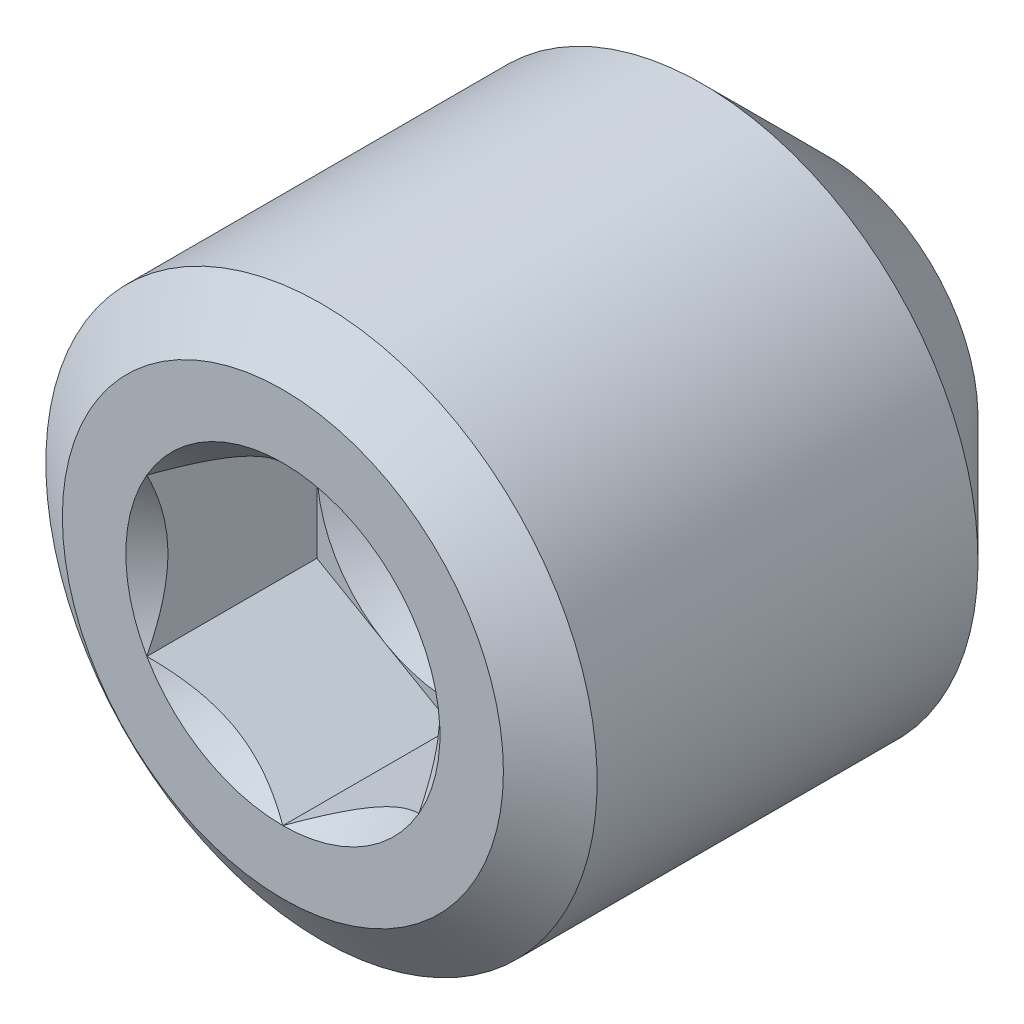
ISO-10303-21;
HEADER;
FILE_DESCRIPTION(('STEP AP214'),'2;1');
FILE_NAME('part.step','',(''),(''),'','','');
FILE_SCHEMA(('AUTOMOTIVE_DESIGN { 1 0 10303 214 1 1 1 1 }'));
ENDSEC;
DATA;
#1=APPLICATION_CONTEXT('core data for automotive mechanical design processes');
#2=APPLICATION_PROTOCOL_DEFINITION('international standard','automotive_design',2000,#1);
#3=PRODUCT_CONTEXT('',#1,'mechanical');
#4=PRODUCT('Part','Part','',(#3));
#5=PRODUCT_RELATED_PRODUCT_CATEGORY('part','',(#4));
#6=PRODUCT_DEFINITION_FORMATION('','',#4);
#7=PRODUCT_DEFINITION_CONTEXT('part definition',#1,'design');
#8=PRODUCT_DEFINITION('design','',#6,#7);
#9=PRODUCT_DEFINITION_SHAPE('','',#8);
#10=(LENGTH_UNIT() NAMED_UNIT(*) SI_UNIT(.MILLI.,.METRE.));
#11=(NAMED_UNIT(*) PLANE_ANGLE_UNIT() SI_UNIT($,.RADIAN.));
#12=(NAMED_UNIT(*) SI_UNIT($,.STERADIAN.) SOLID_ANGLE_UNIT());
#13=UNCERTAINTY_MEASURE_WITH_UNIT(LENGTH_MEASURE(1.E-05),#10,'distance_accuracy_value','');
#14=(GEOMETRIC_REPRESENTATION_CONTEXT(3) GLOBAL_UNCERTAINTY_ASSIGNED_CONTEXT((#13)) GLOBAL_UNIT_ASSIGNED_CONTEXT((#10,
#11,#12)) REPRESENTATION_CONTEXT('',''));
#15=CARTESIAN_POINT('',(0.,0.,0.));
#16=DIRECTION('',(0.,0.,1.));
#17=DIRECTION('',(1.,0.,0.));
#18=AXIS2_PLACEMENT_3D('',#15,#16,#17);
#19=CARTESIAN_POINT('',(0.,0.,0.495727982126937));
#20=DIRECTION('',(0.,0.,1.));
#21=DIRECTION('',(0.,-1.,0.));
#22=AXIS2_PLACEMENT_3D('',#19,#20,#21);
#23=CONICAL_SURFACE('',#22,1.19062499987876,1.04719755103086);
#24=CARTESIAN_POINT('',(2.55351295663786E-10,-1.4210854715202E-11,-0.19167968210354));
#25=VERTEX_POINT('',#24);
#26=VERTEX_LOOP('',#25);
#27=FACE_BOUND('',#26,.T.);
#28=CARTESIAN_POINT('',(0.,0.,0.495727982192662));
#29=DIRECTION('',(0.,0.,1.));
#30=DIRECTION('',(0.,-1.,0.));
#31=AXIS2_PLACEMENT_3D('',#28,#29,#30);
#32=CIRCLE('',#31,1.19062499999245);
#33=CARTESIAN_POINT('',(1.190624999996,-7.105427357601E-12,0.495727982183336));
#34=VERTEX_POINT('',#33);
#35=CARTESIAN_POINT('',(0.595312499997558,-1.0311114963848,0.495727982183336));
#36=VERTEX_POINT('',#35);
#37=EDGE_CURVE('E100',#34,#36,#32,.F.);
#38=ORIENTED_EDGE('',*,*,#37,.F.);
#39=CARTESIAN_POINT('',(0.,0.,0.495727982192662));
#40=DIRECTION('',(0.,0.,1.));
#41=DIRECTION('',(0.,-1.,0.));
#42=AXIS2_PLACEMENT_3D('',#39,#40,#41);
#43=CIRCLE('',#42,1.19062499999245);
#44=CARTESIAN_POINT('',(0.595312499999334,1.03111149636348,0.495727982183336));
#45=VERTEX_POINT('',#44);
#46=EDGE_CURVE('E114',#45,#34,#43,.F.);
#47=ORIENTED_EDGE('',*,*,#46,.F.);
#48=CARTESIAN_POINT('',(0.,0.,0.495727982192662));
#49=DIRECTION('',(0.,0.,1.));
#50=DIRECTION('',(0.,-1.,0.));
#51=AXIS2_PLACEMENT_3D('',#48,#49,#50);
#52=CIRCLE('',#51,1.19062499999245);
#53=CARTESIAN_POINT('',(-0.595312499998446,1.03111149636348,0.495727982183336));
#54=VERTEX_POINT('',#53);
#55=EDGE_CURVE('E255',#54,#45,#52,.F.);
#56=ORIENTED_EDGE('',*,*,#55,.F.);
#57=CARTESIAN_POINT('',(0.,0.,0.495727982192662));
#58=DIRECTION('',(0.,0.,1.));
#59=DIRECTION('',(0.,-1.,0.));
#60=AXIS2_PLACEMENT_3D('',#57,#58,#59);
#61=CIRCLE('',#60,1.19062499999245);
#62=CARTESIAN_POINT('',(-1.19062499999645,-1.24344978758018E-11,0.495727982183336));
#63=VERTEX_POINT('',#62);
#64=EDGE_CURVE('E151',#63,#54,#61,.F.);
#65=ORIENTED_EDGE('',*,*,#64,.F.);
#66=CARTESIAN_POINT('',(0.,0.,0.495727982192662));
#67=DIRECTION('',(0.,0.,1.));
#68=DIRECTION('',(0.,-1.,0.));
#69=AXIS2_PLACEMENT_3D('',#66,#67,#68);
#70=CIRCLE('',#69,1.19062499999245);
#71=CARTESIAN_POINT('',(-0.595312499998446,-1.0311114963848,0.495727982183336));
#72=VERTEX_POINT('',#71);
#73=EDGE_CURVE('E19',#72,#63,#70,.F.);
#74=ORIENTED_EDGE('',*,*,#73,.F.);
#75=CARTESIAN_POINT('',(0.,0.,0.495727982192662));
#76=DIRECTION('',(0.,0.,1.));
#77=DIRECTION('',(0.,-1.,0.));
#78=AXIS2_PLACEMENT_3D('',#75,#76,#77);
#79=CIRCLE('',#78,1.19062499999245);
#80=EDGE_CURVE('E379',#36,#72,#79,.F.);
#81=ORIENTED_EDGE('',*,*,#80,.F.);
#82=EDGE_LOOP('',(#38,#47,#56,#65,#74,#81));
#83=FACE_BOUND('',#82,.T.);
#84=ADVANCED_FACE('F16',(#27,#83),#23,.F.);
#85=CARTESIAN_POINT('',(-1.19062500000044,2.06222299274827,0.495727982174454));
#86=DIRECTION('',(0.,0.,1.));
#87=DIRECTION('',(0.,-1.,0.));
#88=AXIS2_PLACEMENT_3D('',#85,#86,#87);
#89=PLANE('',#88);
#90=DIRECTION('',(0.,-1.,0.));
#91=VECTOR('',#90,1.);
#92=CARTESIAN_POINT('',(-1.19062500000089,0.687407664246464,0.495727982174454));
#93=LINE('',#92,#91);
#94=CARTESIAN_POINT('',(-1.190625,-0.687407664262452,0.495727982174454));
#95=VERTEX_POINT('',#94);
#96=EDGE_CURVE('E83',#63,#95,#93,.T.);
#97=ORIENTED_EDGE('',*,*,#96,.T.);
#98=DIRECTION('',(0.866025403784439,-0.500000000000002,0.));
#99=VECTOR('',#98,1.);
#100=CARTESIAN_POINT('',(-1.190625,-0.687407664262452,0.495727982174454));
#101=LINE('',#100,#99);
#102=EDGE_CURVE('E167',#95,#72,#101,.T.);
#103=ORIENTED_EDGE('',*,*,#102,.T.);
#104=ORIENTED_EDGE('',*,*,#73,.T.);
#105=EDGE_LOOP('',(#97,#103,#104));
#106=FACE_BOUND('',#105,.T.);
#107=ADVANCED_FACE('F272',(#106),#89,.T.);
#108=CARTESIAN_POINT('',(-1.19062500000044,2.06222299274827,0.495727982174454));
#109=DIRECTION('',(0.,0.,1.));
#110=DIRECTION('',(0.,-1.,0.));
#111=AXIS2_PLACEMENT_3D('',#108,#109,#110);
#112=PLANE('',#111);
#113=DIRECTION('',(0.866025403784439,-0.500000000000002,0.));
#114=VECTOR('',#113,1.);
#115=CARTESIAN_POINT('',(-1.190625,-0.687407664262452,0.495727982174454));
#116=LINE('',#115,#114);
#117=CARTESIAN_POINT('',(-4.44089209850063E-13,-1.37481532852135,0.495727982174454));
#118=VERTEX_POINT('',#117);
#119=EDGE_CURVE('E133',#72,#118,#116,.T.);
#120=ORIENTED_EDGE('',*,*,#119,.T.);
#121=DIRECTION('',(0.866025403784439,0.5,0.));
#122=VECTOR('',#121,1.);
#123=CARTESIAN_POINT('',(-4.44089209850063E-13,-1.37481532852135,0.495727982174454));
#124=LINE('',#123,#122);
#125=EDGE_CURVE('E105',#118,#36,#124,.T.);
#126=ORIENTED_EDGE('',*,*,#125,.T.);
#127=ORIENTED_EDGE('',*,*,#80,.T.);
#128=EDGE_LOOP('',(#120,#126,#127));
#129=FACE_BOUND('',#128,.T.);
#130=ADVANCED_FACE('F270',(#129),#112,.T.);
#131=CARTESIAN_POINT('',(-1.19062500000044,2.06222299274827,0.495727982174454));
#132=DIRECTION('',(0.,0.,1.));
#133=DIRECTION('',(0.,-1.,0.));
#134=AXIS2_PLACEMENT_3D('',#131,#132,#133);
#135=PLANE('',#134);
#136=DIRECTION('',(0.866025403784439,0.5,0.));
#137=VECTOR('',#136,1.);
#138=CARTESIAN_POINT('',(-4.44089209850063E-13,-1.37481532852135,0.495727982174454));
#139=LINE('',#138,#137);
#140=CARTESIAN_POINT('',(1.190625,-0.687407664267781,0.495727982174454));
#141=VERTEX_POINT('',#140);
#142=EDGE_CURVE('E95',#36,#141,#139,.T.);
#143=ORIENTED_EDGE('',*,*,#142,.T.);
#144=DIRECTION('',(0.,1.,0.));
#145=VECTOR('',#144,1.);
#146=CARTESIAN_POINT('',(1.190625,-0.687407664267781,0.495727982174454));
#147=LINE('',#146,#145);
#148=EDGE_CURVE('E98',#141,#34,#147,.T.);
#149=ORIENTED_EDGE('',*,*,#148,.T.);
#150=ORIENTED_EDGE('',*,*,#37,.T.);
#151=EDGE_LOOP('',(#143,#149,#150));
#152=FACE_BOUND('',#151,.T.);
#153=ADVANCED_FACE('F97',(#152),#135,.T.);
#154=CARTESIAN_POINT('',(-1.19062500000044,2.06222299274827,0.495727982174454));
#155=DIRECTION('',(0.,0.,1.));
#156=DIRECTION('',(0.,-1.,0.));
#157=AXIS2_PLACEMENT_3D('',#154,#155,#156);
#158=PLANE('',#157);
#159=DIRECTION('',(0.,1.,0.));
#160=VECTOR('',#159,1.);
#161=CARTESIAN_POINT('',(1.190625,-0.687407664267781,0.495727982174454));
#162=LINE('',#161,#160);
#163=CARTESIAN_POINT('',(1.19062500000044,0.687407664241135,0.495727982174454));
#164=VERTEX_POINT('',#163);
#165=EDGE_CURVE('E113',#34,#164,#162,.T.);
#166=ORIENTED_EDGE('',*,*,#165,.T.);
#167=DIRECTION('',(-0.86602540378444,0.500000000000002,0.));
#168=VECTOR('',#167,1.);
#169=CARTESIAN_POINT('',(1.19062500000044,0.687407664241135,0.495727982174454));
#170=LINE('',#169,#168);
#171=EDGE_CURVE('E124',#164,#45,#170,.T.);
#172=ORIENTED_EDGE('',*,*,#171,.T.);
#173=ORIENTED_EDGE('',*,*,#46,.T.);
#174=EDGE_LOOP('',(#166,#172,#173));
#175=FACE_BOUND('',#174,.T.);
#176=ADVANCED_FACE('F263',(#175),#158,.T.);
#177=CARTESIAN_POINT('',(1.190625,-0.687407664267781,0.495727982174454));
#178=DIRECTION('',(1.,0.,0.));
#179=DIRECTION('',(0.,1.,0.));
#180=AXIS2_PLACEMENT_3D('',#177,#178,#179);
#181=PLANE('',#180);
#182=CARTESIAN_POINT('',(1.19062499999556,0.687407664289097,1.98400923211484));
#183=CARTESIAN_POINT('',(1.1906249999984,0.640463282074573,1.96055894231369));
#184=CARTESIAN_POINT('',(1.19062499999957,0.592738991384884,1.93847791824531));
#185=CARTESIAN_POINT('',(1.19062500000044,0.495406225211971,1.89800295513786));
#186=CARTESIAN_POINT('',(1.19062500000012,0.445787629505238,1.87963356850172));
#187=CARTESIAN_POINT('',(1.19062499999989,0.3451163757076,1.84791358583423));
#188=CARTESIAN_POINT('',(1.19062499999997,0.294069215437679,1.83454600462104));
#189=CARTESIAN_POINT('',(1.19062500000003,0.190855854632015,1.81396603547113));
#190=CARTESIAN_POINT('',(1.190625,0.138693632933228,1.8067346135158));
#191=CARTESIAN_POINT('',(1.190625,0.071951112856019,1.80190389372878));
#192=CARTESIAN_POINT('',(1.190625,0.0575681065408894,1.80112291749213));
#193=CARTESIAN_POINT('',(1.190625,0.0287907386402001,1.80008032792752));
#194=CARTESIAN_POINT('',(1.190625,0.0143963874795497,1.79981843246641));
#195=CARTESIAN_POINT('',(1.190625,-0.0361321030584912,1.79982008619975));
#196=CARTESIAN_POINT('',(1.19062500000002,-0.072277033158264,1.80147394594917));
#197=CARTESIAN_POINT('',(1.19062499999998,-0.144284982616348,1.80799116290055));
#198=CARTESIAN_POINT('',(1.19062499999991,-0.180147787681774,1.81285675865009));
#199=CARTESIAN_POINT('',(1.19062500000018,-0.287258251721114,1.8319669698351));
#200=CARTESIAN_POINT('',(1.19062500000101,-0.35772529740938,1.85072176782383));
#201=CARTESIAN_POINT('',(1.19062500000081,-0.471552892513589,1.88908925370785));
#202=CARTESIAN_POINT('',(1.19062500000033,-0.515840765963648,1.90614997876421));
#203=CARTESIAN_POINT('',(1.19062499999967,-0.60273957314956,1.94312607455278));
#204=CARTESIAN_POINT('',(1.1906249999995,-0.645362139972149,1.96301390794671));
#205=CARTESIAN_POINT('',(1.190625,-0.687407664294426,1.98400923211306));
#206=B_SPLINE_CURVE_WITH_KNOTS('',3,(#182,#183,#184,#185,#186,#187,#188,#189,#190,#191,#192,
#193,#194,#195,#196,#197,#198,#199,#200,#201,#202,#203,#204,#205),.UNSPECIFIED.,.F.,.F.,(4,2,2,
2,2,2,2,2,2,2,2,4),(0.,0.157535403144177,0.316081041542013,0.47408329470111,0.631593623247327,
0.674799715143058,0.717982317018622,0.826362160395384,0.934817623304514,1.15262451061384,
1.29491478060888,1.43590359051069),.UNSPECIFIED.);
#207=CARTESIAN_POINT('',(1.19062500005773,0.687407664239359,1.9840092321366));
#208=VERTEX_POINT('',#207);
#209=CARTESIAN_POINT('',(1.19062500002931,-0.687407664285544,1.98400923212683));
#210=VERTEX_POINT('',#209);
#211=EDGE_CURVE('E159',#208,#210,#206,.T.);
#212=ORIENTED_EDGE('',*,*,#211,.F.);
#213=DIRECTION('',(0.,0.,1.));
#214=VECTOR('',#213,1.);
#215=CARTESIAN_POINT('',(1.19062500000044,0.687407664241135,0.495727982174454));
#216=LINE('',#215,#214);
#217=EDGE_CURVE('E139',#208,#164,#216,.F.);
#218=ORIENTED_EDGE('',*,*,#217,.T.);
#219=ORIENTED_EDGE('',*,*,#165,.F.);
#220=ORIENTED_EDGE('',*,*,#148,.F.);
#221=DIRECTION('',(0.,0.,1.));
#222=VECTOR('',#221,1.);
#223=CARTESIAN_POINT('',(1.190625,-0.687407664267781,0.495727982174454));
#224=LINE('',#223,#222);
#225=EDGE_CURVE('E104',#141,#210,#224,.T.);
#226=ORIENTED_EDGE('',*,*,#225,.T.);
#227=EDGE_LOOP('',(#212,#218,#219,#220,#226));
#228=FACE_BOUND('',#227,.T.);
#229=ADVANCED_FACE('F110',(#228),#181,.F.);
#230=CARTESIAN_POINT('',(-1.19062500000044,2.06222299274827,0.495727982174454));
#231=DIRECTION('',(0.,0.,1.));
#232=DIRECTION('',(0.,-1.,0.));
#233=AXIS2_PLACEMENT_3D('',#230,#231,#232);
#234=PLANE('',#233);
#235=DIRECTION('',(-0.86602540378444,0.500000000000002,0.));
#236=VECTOR('',#235,1.);
#237=CARTESIAN_POINT('',(1.19062500000044,0.687407664241135,0.495727982174454));
#238=LINE('',#237,#236);
#239=CARTESIAN_POINT('',(1.77635683940025E-12,1.37481532850714,0.495727982174454));
#240=VERTEX_POINT('',#239);
#241=EDGE_CURVE('E136',#45,#240,#238,.T.);
#242=ORIENTED_EDGE('',*,*,#241,.T.);
#243=DIRECTION('',(-0.866025403784439,-0.5,0.));
#244=VECTOR('',#243,1.);
#245=CARTESIAN_POINT('',(1.77635683940025E-12,1.37481532850714,0.495727982174454));
#246=LINE('',#245,#244);
#247=EDGE_CURVE('E142',#240,#54,#246,.T.);
#248=ORIENTED_EDGE('',*,*,#247,.T.);
#249=ORIENTED_EDGE('',*,*,#55,.T.);
#250=EDGE_LOOP('',(#242,#248,#249));
#251=FACE_BOUND('',#250,.T.);
#252=ADVANCED_FACE('F262',(#251),#234,.T.);
#253=CARTESIAN_POINT('',(-1.19062500000044,2.06222299274827,0.495727982174454));
#254=DIRECTION('',(0.,0.,1.));
#255=DIRECTION('',(0.,-1.,0.));
#256=AXIS2_PLACEMENT_3D('',#253,#254,#255);
#257=PLANE('',#256);
#258=DIRECTION('',(-0.866025403784439,-0.5,0.));
#259=VECTOR('',#258,1.);
#260=CARTESIAN_POINT('',(1.77635683940025E-12,1.37481532850714,0.495727982174454));
#261=LINE('',#260,#259);
#262=CARTESIAN_POINT('',(-1.19062500000089,0.687407664246464,0.495727982174454));
#263=VERTEX_POINT('',#262);
#264=EDGE_CURVE('E145',#54,#263,#261,.T.);
#265=ORIENTED_EDGE('',*,*,#264,.T.);
#266=DIRECTION('',(0.,-1.,0.));
#267=VECTOR('',#266,1.);
#268=CARTESIAN_POINT('',(-1.19062500000089,0.687407664246464,0.495727982174454));
#269=LINE('',#268,#267);
#270=EDGE_CURVE('E148',#263,#63,#269,.T.);
#271=ORIENTED_EDGE('',*,*,#270,.T.);
#272=ORIENTED_EDGE('',*,*,#64,.T.);
#273=EDGE_LOOP('',(#265,#271,#272));
#274=FACE_BOUND('',#273,.T.);
#275=ADVANCED_FACE('F365',(#274),#257,.T.);
#276=CARTESIAN_POINT('',(-1.19062500000089,0.687407664246464,0.495727982174454));
#277=DIRECTION('',(-1.,0.,0.));
#278=DIRECTION('',(0.,-1.,0.));
#279=AXIS2_PLACEMENT_3D('',#276,#277,#278);
#280=PLANE('',#279);
#281=CARTESIAN_POINT('',(-1.19062499999689,0.687407664289097,1.98400923211572));
#282=CARTESIAN_POINT('',(-1.19062499999953,0.640154592182397,1.96040536744295));
#283=CARTESIAN_POINT('',(-1.19062500000054,0.592111444460251,1.93818802847184));
#284=CARTESIAN_POINT('',(-1.19062500000124,0.494146535981105,1.89750902941565));
#285=CARTESIAN_POINT('',(-1.19062500000091,0.444215463847035,1.87906999571721));
#286=CARTESIAN_POINT('',(-1.19062500000087,0.343531912612561,1.84748380274666));
#287=CARTESIAN_POINT('',(-1.19062500000114,0.292805060654056,1.83425727427423));
#288=CARTESIAN_POINT('',(-1.19062500000063,0.190234889567651,1.81387930354997));
#289=CARTESIAN_POINT('',(-1.19062499999985,0.13839470162241,1.80671265556498));
#290=CARTESIAN_POINT('',(-1.19062500000011,0.0490434171387624,1.80024610056026));
#291=CARTESIAN_POINT('',(-1.19062500000069,0.0116476312196913,1.79928918177818));
#292=CARTESIAN_POINT('',(-1.19062500000109,-0.0630781169179072,1.80090396128286));
#293=CARTESIAN_POINT('',(-1.19062500000089,-0.100408062772507,1.80347643903115));
#294=CARTESIAN_POINT('',(-1.19062500000089,-0.174707550778307,1.81200130363435));
#295=CARTESIAN_POINT('',(-1.19062500000107,-0.211676725232483,1.81795683342425));
#296=CARTESIAN_POINT('',(-1.19062500000071,-0.284997830962193,1.8329270532167));
#297=CARTESIAN_POINT('',(-1.19062500000016,-0.321349490340824,1.84194305589462));
#298=CARTESIAN_POINT('',(-1.19062499999975,-0.414409407720663,1.86868846791181));
#299=CARTESIAN_POINT('',(-1.19062500000047,-0.47053205912835,1.88842523326287));
#300=CARTESIAN_POINT('',(-1.19062500000131,-0.580581647465353,1.93288237139641));
#301=CARTESIAN_POINT('',(-1.19062500000143,-0.634515062280037,1.9575865213319));
#302=CARTESIAN_POINT('',(-1.190625,-0.687407664303308,1.98400923211395));
#303=B_SPLINE_CURVE_WITH_KNOTS('',3,(#281,#282,#283,#284,#285,#286,#287,#288,#289,#290,#291,
#292,#293,#294,#295,#296,#297,#298,#299,#300,#301,#302),.UNSPECIFIED.,.F.,.F.,(4,2,2,2,2,2,2,2,
2,2,4),(0.,0.158570945781735,0.31806539782726,0.475027617268127,0.63159480107284,
0.74366016076398,0.855750273893167,0.967944692083056,1.08018729280444,1.25836291045971,
1.43596581394564),.UNSPECIFIED.);
#304=CARTESIAN_POINT('',(-1.19062500002842,0.687407664264228,1.98400923212683));
#305=VERTEX_POINT('',#304);
#306=CARTESIAN_POINT('',(-1.19062500005951,-0.687407664250017,1.98400923213704));
#307=VERTEX_POINT('',#306);
#308=EDGE_CURVE('E317',#305,#307,#303,.T.);
#309=ORIENTED_EDGE('',*,*,#308,.T.);
#310=DIRECTION('',(0.,0.,1.));
#311=VECTOR('',#310,1.);
#312=CARTESIAN_POINT('',(-1.190625,-0.687407664262452,0.495727982174454));
#313=LINE('',#312,#311);
#314=EDGE_CURVE('E131',#307,#95,#313,.F.);
#315=ORIENTED_EDGE('',*,*,#314,.T.);
#316=ORIENTED_EDGE('',*,*,#96,.F.);
#317=ORIENTED_EDGE('',*,*,#270,.F.);
#318=DIRECTION('',(0.,0.,1.));
#319=VECTOR('',#318,1.);
#320=CARTESIAN_POINT('',(-1.19062500000089,0.687407664246464,0.495727982174454));
#321=LINE('',#320,#319);
#322=EDGE_CURVE('E155',#263,#305,#321,.T.);
#323=ORIENTED_EDGE('',*,*,#322,.T.);
#324=EDGE_LOOP('',(#309,#315,#316,#317,#323));
#325=FACE_BOUND('',#324,.T.);
#326=ADVANCED_FACE('F336',(#325),#280,.F.);
#327=CARTESIAN_POINT('',(-1.190625,-0.687407664262452,0.495727982174454));
#328=DIRECTION('',(-0.5,-0.866025403784439,0.));
#329=DIRECTION('',(0.866025403784439,-0.500000000000002,0.));
#330=AXIS2_PLACEMENT_3D('',#327,#328,#329);
#331=PLANE('',#330);
#332=CARTESIAN_POINT('',(-1.19062500003375,-0.687407664237583,1.98400923211572));
#333=CARTESIAN_POINT('',(-1.14970263918224,-0.711034200293792,1.96040536744716));
#334=CARTESIAN_POINT('',(-1.10809605277734,-0.735055774156504,1.93818802847732));
#335=CARTESIAN_POINT('',(-1.02325595335482,-0.784038228397947,1.89750902942154));
#336=CARTESIAN_POINT('',(-0.9800143764481,-0.809003764465214,1.87906999572228));
#337=CARTESIAN_POINT('',(-0.892819863334365,-0.859345540081545,1.84748380275269));
#338=CARTESIAN_POINT('',(-0.848889120883299,-0.884708966059667,1.83425727428194));
#339=CARTESIAN_POINT('',(-0.760060747054684,-0.935994051606419,1.81387930355408));
#340=CARTESIAN_POINT('',(-0.715165827360859,-0.9619141455837,1.80671265556379));
#341=CARTESIAN_POINT('',(-0.637785345138153,-1.00658978782268,1.80024610056122));
#342=CARTESIAN_POINT('',(-0.605399644536867,-1.02528768077758,1.79928918178329));
#343=CARTESIAN_POINT('',(-0.540685248333886,-1.06265055484202,1.80090396129061));
#344=CARTESIAN_POINT('',(-0.50835656690377,-1.08131552776959,1.80347643903741));
#345=CARTESIAN_POINT('',(-0.44401132280558,-1.11846527177186,1.81200130363909));
#346=CARTESIAN_POINT('',(-0.41199507857247,-1.13694985899803,1.81795683342896));
#347=CARTESIAN_POINT('',(-0.348497138378873,-1.17361041186119,1.8329270532196));
#348=CARTESIAN_POINT('',(-0.317015677888011,-1.19178624154973,1.84194305589574));
#349=CARTESIAN_POINT('',(-0.236423425361618,-1.23831620023999,1.86868846791133));
#350=CARTESIAN_POINT('',(-0.187819783513171,-1.26637752594494,1.8884252332641));
#351=CARTESIAN_POINT('',(-0.0925140443342337,-1.3214023201171,1.93288237139957));
#352=CARTESIAN_POINT('',(-0.0458063369904475,-1.348369027527,1.95758652133528));
#353=CARTESIAN_POINT('',(3.59712259978551E-11,-1.37481532854267,1.98400923211395));
#354=B_SPLINE_CURVE_WITH_KNOTS('',3,(#332,#333,#334,#335,#336,#337,#338,#339,#340,#341,#342,
#343,#344,#345,#346,#347,#348,#349,#350,#351,#352,#353),.UNSPECIFIED.,.F.,.F.,(4,2,2,2,2,2,2,2,
2,2,4),(0.,0.158570945781518,0.318065397829123,0.475027617270162,0.631594801073887,
0.743660160759904,0.855750273884707,0.967944692070207,1.0801872927873,1.25836291044979,
1.43596581394249),.UNSPECIFIED.);
#355=CARTESIAN_POINT('',(-4.04121180963557E-11,-1.37481532856576,1.98400923213704));
#356=VERTEX_POINT('',#355);
#357=EDGE_CURVE('E322',#307,#356,#354,.T.);
#358=ORIENTED_EDGE('',*,*,#357,.T.);
#359=DIRECTION('',(0.,0.,1.));
#360=VECTOR('',#359,1.);
#361=CARTESIAN_POINT('',(-4.44089209850063E-13,-1.37481532852135,0.495727982174454));
#362=LINE('',#361,#360);
#363=EDGE_CURVE('E121',#356,#118,#362,.F.);
#364=ORIENTED_EDGE('',*,*,#363,.T.);
#365=ORIENTED_EDGE('',*,*,#119,.F.);
#366=ORIENTED_EDGE('',*,*,#102,.F.);
#367=ORIENTED_EDGE('',*,*,#314,.F.);
#368=EDGE_LOOP('',(#358,#364,#365,#366,#367));
#369=FACE_BOUND('',#368,.T.);
#370=ADVANCED_FACE('F358',(#369),#331,.F.);
#371=CARTESIAN_POINT('',(-4.44089209850063E-13,-1.37481532852135,0.495727982174454));
#372=DIRECTION('',(0.500000000000001,-0.866025403784441,0.));
#373=DIRECTION('',(0.866025403784439,0.5,0.));
#374=AXIS2_PLACEMENT_3D('',#371,#372,#373);
#375=PLANE('',#374);
#376=CARTESIAN_POINT('',(-3.81916720471054E-11,-1.37481532853201,1.98400923211572));
#377=CARTESIAN_POINT('',(0.0409223608183264,-1.35118879248267,1.96040536745191));
#378=CARTESIAN_POINT('',(0.0825289472250635,-1.32716721862365,1.93818802848377));
#379=CARTESIAN_POINT('',(0.167369046648473,-1.27818476438571,1.89750902942892));
#380=CARTESIAN_POINT('',(0.210610623554248,-1.25321922831823,1.87906999572894));
#381=CARTESIAN_POINT('',(0.297805136665731,-1.20287745270072,1.84748380275982));
#382=CARTESIAN_POINT('',(0.341735879115486,-1.17751402672165,1.83425727429021));
#383=CARTESIAN_POINT('',(0.430564252944685,-1.12622894118041,1.81387930355865));
#384=CARTESIAN_POINT('',(0.47545917264039,-1.10030884720958,1.80671265556349));
#385=CARTESIAN_POINT('',(0.552839654860742,-1.05563320496926,1.80024610056139));
#386=CARTESIAN_POINT('',(0.585225355459541,-1.03693531201001,1.79928918178632));
#387=CARTESIAN_POINT('',(0.64993975166087,-0.999572437942574,1.8009039612951));
#388=CARTESIAN_POINT('',(0.682268433091823,-0.980907465016348,1.80347643904051));
#389=CARTESIAN_POINT('',(0.746613677190298,-0.943757721014217,1.81200130364052));
#390=CARTESIAN_POINT('',(0.778629921422855,-0.925273133786822,1.81795683343009));
#391=CARTESIAN_POINT('',(0.842127861617899,-0.888612580925606,1.83292705322019));
#392=CARTESIAN_POINT('',(0.873609322110761,-0.870436751240239,1.84194305589609));
#393=CARTESIAN_POINT('',(0.954201574639311,-0.823906792552341,1.86868846791081));
#394=CARTESIAN_POINT('',(1.00280521648607,-0.795845466843196,1.8884252332628));
#395=CARTESIAN_POINT('',(1.09811095566217,-0.740820672664383,1.93288237139753));
#396=CARTESIAN_POINT('',(1.14481866300482,-0.713853965252028,1.95758652133326));
#397=CARTESIAN_POINT('',(1.19062500003375,-0.687407664241135,1.98400923211306));
#398=B_SPLINE_CURVE_WITH_KNOTS('',3,(#376,#377,#378,#379,#380,#381,#382,#383,#384,#385,#386,
#387,#388,#389,#390,#391,#392,#393,#394,#395,#396,#397),.UNSPECIFIED.,.F.,.F.,(4,2,2,2,2,2,2,2,
2,2,4),(0.,0.158570945778493,0.318065397824789,0.475027617263527,0.631594801064125,
0.743660160749816,0.855750273874792,0.967944692060373,1.08018729277778,1.25836291044123,
1.43596581393463),.UNSPECIFIED.);
#399=EDGE_CURVE('E119',#356,#210,#398,.T.);
#400=ORIENTED_EDGE('',*,*,#399,.T.);
#401=ORIENTED_EDGE('',*,*,#225,.F.);
#402=ORIENTED_EDGE('',*,*,#142,.F.);
#403=ORIENTED_EDGE('',*,*,#125,.F.);
#404=ORIENTED_EDGE('',*,*,#363,.F.);
#405=EDGE_LOOP('',(#400,#401,#402,#403,#404));
#406=FACE_BOUND('',#405,.T.);
#407=ADVANCED_FACE('F116',(#406),#375,.F.);
#408=CARTESIAN_POINT('',(1.19062500000044,0.687407664241135,0.495727982174454));
#409=DIRECTION('',(0.5,0.86602540378444,0.));
#410=DIRECTION('',(-0.86602540378444,0.500000000000002,0.));
#411=AXIS2_PLACEMENT_3D('',#408,#409,#410);
#412=PLANE('',#411);
#413=CARTESIAN_POINT('',(1.1906250000302,0.687407664221595,1.98400923211484));
#414=CARTESIAN_POINT('',(1.14970263917974,0.711034200274823,1.96040536743733));
#415=CARTESIAN_POINT('',(1.10809605277492,0.735055774136912,1.93818802846475));
#416=CARTESIAN_POINT('',(1.02325595335358,0.784038228377534,1.89750902940791));
#417=CARTESIAN_POINT('',(0.980014376448007,0.809003764444577,1.87906999571018));
#418=CARTESIAN_POINT('',(0.892819863336214,0.859345540059056,1.84748380273744));
#419=CARTESIAN_POINT('',(0.848889120885923,0.884708966035585,1.83425727426216));
#420=CARTESIAN_POINT('',(0.760060747058237,0.935994051584812,1.81387930354372));
#421=CARTESIAN_POINT('',(0.715165827364537,0.961914145566164,1.80671265556748));
#422=CARTESIAN_POINT('',(0.637785345139678,1.006589787805,1.80024610055855));
#423=CARTESIAN_POINT('',(0.605399644536666,1.02528768075777,1.79928918176889));
#424=CARTESIAN_POINT('',(0.540685248332495,1.06265055482063,1.80090396126813));
#425=CARTESIAN_POINT('',(0.508356566902914,1.08131552774876,1.8034764390185));
#426=CARTESIAN_POINT('',(0.444011322804208,1.11846527175186,1.81200130361965));
#427=CARTESIAN_POINT('',(0.411995078570049,1.13694985897832,1.81795683340545));
#428=CARTESIAN_POINT('',(0.348497138377735,1.17361041184084,1.83292705320394));
#429=CARTESIAN_POINT('',(0.317015677889209,1.19178624152845,1.84194305589203));
#430=CARTESIAN_POINT('',(0.236423425362963,1.23831620021872,1.86868846791729));
#431=CARTESIAN_POINT('',(0.187819783508982,1.26637752592597,1.88842523325531));
#432=CARTESIAN_POINT('',(0.0925140443242337,1.32140232010215,1.93288237137314));
#433=CARTESIAN_POINT('',(0.0458063369801493,1.34836902751377,1.95758652130591));
#434=CARTESIAN_POINT('',(-3.59712259978551E-11,1.37481532852846,1.98400923211395));
#435=B_SPLINE_CURVE_WITH_KNOTS('',3,(#413,#414,#415,#416,#417,#418,#419,#420,#421,#422,#423,
#424,#425,#426,#427,#428,#429,#430,#431,#432,#433,#434),.UNSPECIFIED.,.F.,.F.,(4,2,2,2,2,2,2,2,
2,2,4),(0.,0.158570945784662,0.318065397828007,0.475027617266539,0.631594801071782,
0.743660160760323,0.855750273884786,0.967944692071018,1.08018729278969,1.25836291045543,
1.43596581395099),.UNSPECIFIED.);
#436=CARTESIAN_POINT('',(3.99680288865056E-11,1.37481532855155,1.98400923213704));
#437=VERTEX_POINT('',#436);
#438=EDGE_CURVE('E34',#208,#437,#435,.T.);
#439=ORIENTED_EDGE('',*,*,#438,.T.);
#440=DIRECTION('',(0.,0.,1.));
#441=VECTOR('',#440,1.);
#442=CARTESIAN_POINT('',(1.77635683940025E-12,1.37481532850714,0.495727982174454));
#443=LINE('',#442,#441);
#444=EDGE_CURVE('E315',#437,#240,#443,.F.);
#445=ORIENTED_EDGE('',*,*,#444,.T.);
#446=ORIENTED_EDGE('',*,*,#241,.F.);
#447=ORIENTED_EDGE('',*,*,#171,.F.);
#448=ORIENTED_EDGE('',*,*,#217,.F.);
#449=EDGE_LOOP('',(#439,#445,#446,#447,#448));
#450=FACE_BOUND('',#449,.T.);
#451=ADVANCED_FACE('F357',(#450),#412,.F.);
#452=CARTESIAN_POINT('',(1.77635683940025E-12,1.37481532850714,0.495727982174454));
#453=DIRECTION('',(-0.500000000000001,0.866025403784441,0.));
#454=DIRECTION('',(-0.866025403784439,-0.5,0.));
#455=AXIS2_PLACEMENT_3D('',#452,#453,#454);
#456=PLANE('',#455);
#457=CARTESIAN_POINT('',(3.64153152077051E-11,1.37481532851247,1.98400923211572));
#458=CARTESIAN_POINT('',(-0.040922360818665,1.35118879246676,1.96040536744125));
#459=CARTESIAN_POINT('',(-0.0825289472253031,1.32716721860846,1.93818802846957));
#460=CARTESIAN_POINT('',(-0.167369046648449,1.27818476437082,1.89750902941318));
#461=CARTESIAN_POINT('',(-0.21061062355402,1.25321922830293,1.87906999571508));
#462=CARTESIAN_POINT('',(-0.297805136665481,1.20287745268632,1.84748380274452));
#463=CARTESIAN_POINT('',(-0.34173587911543,1.17751402670853,1.83425727427172));
#464=CARTESIAN_POINT('',(-0.430564252944477,1.12622894116373,1.81387930354878));
#465=CARTESIAN_POINT('',(-0.475459172639857,1.10030884718806,1.80671265556552));
#466=CARTESIAN_POINT('',(-0.552839654862542,1.05563320494815,1.80024610055995));
#467=CARTESIAN_POINT('',(-0.585225355463145,1.03693531199168,1.7992891817763));
#468=CARTESIAN_POINT('',(-0.649939751665587,0.999572437926137,1.80090396127971));
#469=CARTESIAN_POINT('',(-0.682268433095848,0.980907464999017,1.80347643902827));
#470=CARTESIAN_POINT('',(-0.746613677194548,0.943757720996809,1.8120013036298));
#471=CARTESIAN_POINT('',(-0.778629921428023,0.925273133770234,1.81795683341777));
#472=CARTESIAN_POINT('',(-0.84212786162108,0.888612580907412,1.83292705321214));
#473=CARTESIAN_POINT('',(-0.873609322111036,0.870436751219617,1.84194305589393));
#474=CARTESIAN_POINT('',(-0.954201574638312,0.823906792529585,1.86868846791444));
#475=CARTESIAN_POINT('',(-1.00280521649,0.795845466823384,1.88842523326073));
#476=CARTESIAN_POINT('',(-1.09811095567173,0.740820672646438,1.93288237138822));
#477=CARTESIAN_POINT('',(-1.14481866301507,0.713853965233017,1.95758652132238));
#478=CARTESIAN_POINT('',(-1.19062500003508,0.687407664212714,1.98400923211395));
#479=B_SPLINE_CURVE_WITH_KNOTS('',3,(#457,#458,#459,#460,#461,#462,#463,#464,#465,#466,#467,
#468,#469,#470,#471,#472,#473,#474,#475,#476,#477,#478),.UNSPECIFIED.,.F.,.F.,(4,2,2,2,2,2,2,2,
2,2,4),(0.,0.158570945782281,0.318065397826926,0.475027617265447,0.631594801068658,
0.74366016075585,0.855750273880451,0.967944692066375,1.08018729278427,1.2583629104506,
1.43596581394678),.UNSPECIFIED.);
#480=EDGE_CURVE('E207',#437,#305,#479,.T.);
#481=ORIENTED_EDGE('',*,*,#480,.T.);
#482=ORIENTED_EDGE('',*,*,#322,.F.);
#483=ORIENTED_EDGE('',*,*,#264,.F.);
#484=ORIENTED_EDGE('',*,*,#247,.F.);
#485=ORIENTED_EDGE('',*,*,#444,.F.);
#486=EDGE_LOOP('',(#481,#482,#483,#484,#485));
#487=FACE_BOUND('',#486,.T.);
#488=ADVANCED_FACE('F223',(#487),#456,.F.);
#489=CARTESIAN_POINT('',(0.,0.,1.98400923216013));
#490=DIRECTION('',(0.,0.,1.));
#491=DIRECTION('',(1.,0.,0.));
#492=AXIS2_PLACEMENT_3D('',#489,#490,#491);
#493=CONICAL_SURFACE('',#492,1.37481532857464,0.785398163397448);
#494=ORIENTED_EDGE('',*,*,#308,.F.);
#495=CARTESIAN_POINT('',(0.,0.,1.98400923216013));
#496=DIRECTION('',(0.,0.,1.));
#497=DIRECTION('',(1.,0.,0.));
#498=AXIS2_PLACEMENT_3D('',#495,#496,#497);
#499=CIRCLE('',#498,1.37481532857464);
#500=EDGE_CURVE('E204',#305,#307,#499,.T.);
#501=ORIENTED_EDGE('',*,*,#500,.T.);
#502=EDGE_LOOP('',(#494,#501));
#503=FACE_BOUND('',#502,.T.);
#504=ADVANCED_FACE('F318',(#503),#493,.F.);
#505=CARTESIAN_POINT('',(0.,0.,1.98400923216013));
#506=DIRECTION('',(0.,0.,1.));
#507=DIRECTION('',(1.,0.,0.));
#508=AXIS2_PLACEMENT_3D('',#505,#506,#507);
#509=CONICAL_SURFACE('',#508,1.37481532857464,0.785398163397448);
#510=ORIENTED_EDGE('',*,*,#357,.F.);
#511=CARTESIAN_POINT('',(0.,0.,1.98400923216013));
#512=DIRECTION('',(0.,0.,1.));
#513=DIRECTION('',(1.,0.,0.));
#514=AXIS2_PLACEMENT_3D('',#511,#512,#513);
#515=CIRCLE('',#514,1.37481532857464);
#516=EDGE_CURVE('E201',#307,#356,#515,.T.);
#517=ORIENTED_EDGE('',*,*,#516,.T.);
#518=EDGE_LOOP('',(#510,#517));
#519=FACE_BOUND('',#518,.T.);
#520=ADVANCED_FACE('F340',(#519),#509,.F.);
#521=CARTESIAN_POINT('',(0.,0.,1.98400923216013));
#522=DIRECTION('',(0.,0.,1.));
#523=DIRECTION('',(1.,0.,0.));
#524=AXIS2_PLACEMENT_3D('',#521,#522,#523);
#525=CONICAL_SURFACE('',#524,1.37481532857464,0.785398163397448);
#526=ORIENTED_EDGE('',*,*,#399,.F.);
#527=CARTESIAN_POINT('',(0.,0.,1.98400923216013));
#528=DIRECTION('',(0.,0.,1.));
#529=DIRECTION('',(1.,0.,0.));
#530=AXIS2_PLACEMENT_3D('',#527,#528,#529);
#531=CIRCLE('',#530,1.37481532857464);
#532=EDGE_CURVE('E199',#356,#210,#531,.T.);
#533=ORIENTED_EDGE('',*,*,#532,.T.);
#534=EDGE_LOOP('',(#526,#533));
#535=FACE_BOUND('',#534,.T.);
#536=ADVANCED_FACE('F242',(#535),#525,.F.);
#537=CARTESIAN_POINT('',(0.,0.,1.98400923216013));
#538=DIRECTION('',(0.,0.,1.));
#539=DIRECTION('',(1.,0.,0.));
#540=AXIS2_PLACEMENT_3D('',#537,#538,#539);
#541=CONICAL_SURFACE('',#540,1.37481532857464,0.785398163550834);
#542=CARTESIAN_POINT('',(0.,0.,1.98400923216013));
#543=DIRECTION('',(0.,0.,1.));
#544=DIRECTION('',(1.,0.,0.));
#545=AXIS2_PLACEMENT_3D('',#542,#543,#544);
#546=CIRCLE('',#545,1.37481532857464);
#547=EDGE_CURVE('E196',#210,#208,#546,.T.);
#548=ORIENTED_EDGE('',*,*,#547,.T.);
#549=ORIENTED_EDGE('',*,*,#211,.T.);
#550=EDGE_LOOP('',(#548,#549));
#551=FACE_BOUND('',#550,.T.);
#552=ADVANCED_FACE('F237',(#551),#541,.F.);
#553=CARTESIAN_POINT('',(0.,0.,1.98400923216013));
#554=DIRECTION('',(0.,0.,1.));
#555=DIRECTION('',(1.,0.,0.));
#556=AXIS2_PLACEMENT_3D('',#553,#554,#555);
#557=CONICAL_SURFACE('',#556,1.37481532857464,0.785398163397448);
#558=ORIENTED_EDGE('',*,*,#438,.F.);
#559=CARTESIAN_POINT('',(0.,0.,1.98400923216013));
#560=DIRECTION('',(0.,0.,1.));
#561=DIRECTION('',(1.,0.,0.));
#562=AXIS2_PLACEMENT_3D('',#559,#560,#561);
#563=CIRCLE('',#562,1.37481532857464);
#564=EDGE_CURVE('E193',#208,#437,#563,.T.);
#565=ORIENTED_EDGE('',*,*,#564,.T.);
#566=EDGE_LOOP('',(#558,#565));
#567=FACE_BOUND('',#566,.T.);
#568=ADVANCED_FACE('F231',(#567),#557,.F.);
#569=CARTESIAN_POINT('',(0.,0.,1.98400923216013));
#570=DIRECTION('',(0.,0.,1.));
#571=DIRECTION('',(1.,0.,0.));
#572=AXIS2_PLACEMENT_3D('',#569,#570,#571);
#573=CONICAL_SURFACE('',#572,1.37481532857464,0.785398163397448);
#574=ORIENTED_EDGE('',*,*,#480,.F.);
#575=CARTESIAN_POINT('',(0.,0.,1.98400923216013));
#576=DIRECTION('',(0.,0.,1.));
#577=DIRECTION('',(1.,0.,0.));
#578=AXIS2_PLACEMENT_3D('',#575,#576,#577);
#579=CIRCLE('',#578,1.37481532857464);
#580=EDGE_CURVE('E190',#437,#305,#579,.T.);
#581=ORIENTED_EDGE('',*,*,#580,.T.);
#582=EDGE_LOOP('',(#574,#581));
#583=FACE_BOUND('',#582,.T.);
#584=ADVANCED_FACE('F226',(#583),#573,.F.);
#585=CARTESIAN_POINT('',(-4.44089209850063E-13,1.32223931887587,-2.77849076782566));
#586=DIRECTION('',(0.,0.,1.));
#587=DIRECTION('',(0.,-1.,0.));
#588=AXIS2_PLACEMENT_3D('',#585,#586,#587);
#589=PLANE('',#588);
#590=CARTESIAN_POINT('',(0.,0.,-2.77849076780967));
#591=DIRECTION('',(0.,0.,1.));
#592=DIRECTION('',(0.,-1.,0.));
#593=AXIS2_PLACEMENT_3D('',#590,#591,#592);
#594=CIRCLE('',#593,1.3222393188812);
#595=CARTESIAN_POINT('',(0.,-1.3222393188812,-2.77849076780966));
#596=VERTEX_POINT('',#595);
#597=EDGE_CURVE('E187',#596,#596,#594,.T.);
#598=ORIENTED_EDGE('',*,*,#597,.F.);
#599=EDGE_LOOP('',(#598));
#600=FACE_BOUND('',#599,.T.);
#601=ADVANCED_FACE('F230',(#600),#589,.F.);
#602=CARTESIAN_POINT('',(0.,0.,1.98400923217434));
#603=DIRECTION('',(0.,0.,-1.));
#604=DIRECTION('',(0.,1.,0.));
#605=AXIS2_PLACEMENT_3D('',#602,#603,#604);
#606=PLANE('',#605);
#607=CARTESIAN_POINT('',(0.,0.,1.98400923216013));
#608=DIRECTION('',(0.,0.,-1.));
#609=DIRECTION('',(0.,1.,0.));
#610=AXIS2_PLACEMENT_3D('',#607,#608,#609);
#611=CIRCLE('',#610,1.93040000004882);
#612=CARTESIAN_POINT('',(0.,1.93040000004882,1.98400923216012));
#613=VERTEX_POINT('',#612);
#614=EDGE_CURVE('E184',#613,#613,#611,.T.);
#615=ORIENTED_EDGE('',*,*,#614,.F.);
#616=EDGE_LOOP('',(#615));
#617=FACE_BOUND('',#616,.T.);
#618=ORIENTED_EDGE('',*,*,#564,.F.);
#619=ORIENTED_EDGE('',*,*,#547,.F.);
#620=ORIENTED_EDGE('',*,*,#532,.F.);
#621=ORIENTED_EDGE('',*,*,#516,.F.);
#622=ORIENTED_EDGE('',*,*,#500,.F.);
#623=ORIENTED_EDGE('',*,*,#580,.F.);
#624=EDGE_LOOP('',(#618,#619,#620,#621,#622,#623));
#625=FACE_BOUND('',#624,.T.);
#626=ADVANCED_FACE('F295',(#617,#625),#606,.F.);
#627=CARTESIAN_POINT('',(0.,0.,-1.68773008670087));
#628=DIRECTION('',(0.,0.,1.));
#629=DIRECTION('',(0.,-1.,0.));
#630=AXIS2_PLACEMENT_3D('',#627,#628,#629);
#631=CONICAL_SURFACE('',#630,2.41299999993317,0.785398163371396);
#632=CARTESIAN_POINT('',(0.,0.,-1.68773008671597));
#633=DIRECTION('',(0.,0.,1.));
#634=DIRECTION('',(0.,-1.,0.));
#635=AXIS2_PLACEMENT_3D('',#632,#633,#634);
#636=CIRCLE('',#635,2.41299999999999);
#637=CARTESIAN_POINT('',(0.,-2.41299999999999,-1.68773008671595));
#638=VERTEX_POINT('',#637);
#639=EDGE_CURVE('E25',#638,#638,#636,.T.);
#640=ORIENTED_EDGE('',*,*,#639,.F.);
#641=EDGE_LOOP('',(#640));
#642=FACE_BOUND('',#641,.T.);
#643=ORIENTED_EDGE('',*,*,#597,.T.);
#644=EDGE_LOOP('',(#643));
#645=FACE_BOUND('',#644,.T.);
#646=ADVANCED_FACE('F289',(#642,#645),#631,.T.);
#647=CARTESIAN_POINT('',(0.,0.,1.64608907419961));
#648=DIRECTION('',(0.,0.,-1.));
#649=DIRECTION('',(0.,1.,0.));
#650=AXIS2_PLACEMENT_3D('',#647,#648,#649);
#651=CONICAL_SURFACE('',#650,2.41300000004682,0.959931088566411);
#652=CARTESIAN_POINT('',(0.,0.,1.64608907423469));
#653=DIRECTION('',(0.,0.,1.));
#654=DIRECTION('',(0.,-1.,0.));
#655=AXIS2_PLACEMENT_3D('',#652,#653,#654);
#656=CIRCLE('',#655,2.41299999999999);
#657=CARTESIAN_POINT('',(0.,-2.41299999999999,1.6460890742347));
#658=VERTEX_POINT('',#657);
#659=EDGE_CURVE('E11',#658,#658,#656,.F.);
#660=ORIENTED_EDGE('',*,*,#659,.F.);
#661=EDGE_LOOP('',(#660));
#662=FACE_BOUND('',#661,.T.);
#663=ORIENTED_EDGE('',*,*,#614,.T.);
#664=EDGE_LOOP('',(#663));
#665=FACE_BOUND('',#664,.T.);
#666=ADVANCED_FACE('F283',(#662,#665),#651,.T.);
#667=CARTESIAN_POINT('',(0.,0.,-1.98400923217434));
#668=DIRECTION('',(0.,0.,1.));
#669=DIRECTION('',(0.,-1.,0.));
#670=AXIS2_PLACEMENT_3D('',#667,#668,#669);
#671=CYLINDRICAL_SURFACE('',#670,2.41299999999999);
#672=ORIENTED_EDGE('',*,*,#659,.T.);
#673=EDGE_LOOP('',(#672));
#674=FACE_BOUND('',#673,.T.);
#675=ORIENTED_EDGE('',*,*,#639,.T.);
#676=EDGE_LOOP('',(#675));
#677=FACE_BOUND('',#676,.T.);
#678=ADVANCED_FACE('F281',(#674,#677),#671,.T.);
#679=CLOSED_SHELL('',(#84,#107,#130,#153,#176,#229,#252,#275,#326,#370,#407,#451,#488,#504,#520,
#536,#552,#568,#584,#601,#626,#646,#666,#678));
#680=MANIFOLD_SOLID_BREP('B1',#679);
#681=ADVANCED_BREP_SHAPE_REPRESENTATION('',(#18,#680),#14);
#682=SHAPE_DEFINITION_REPRESENTATION(#9,#681);
ENDSEC;
END-ISO-10303-21;
